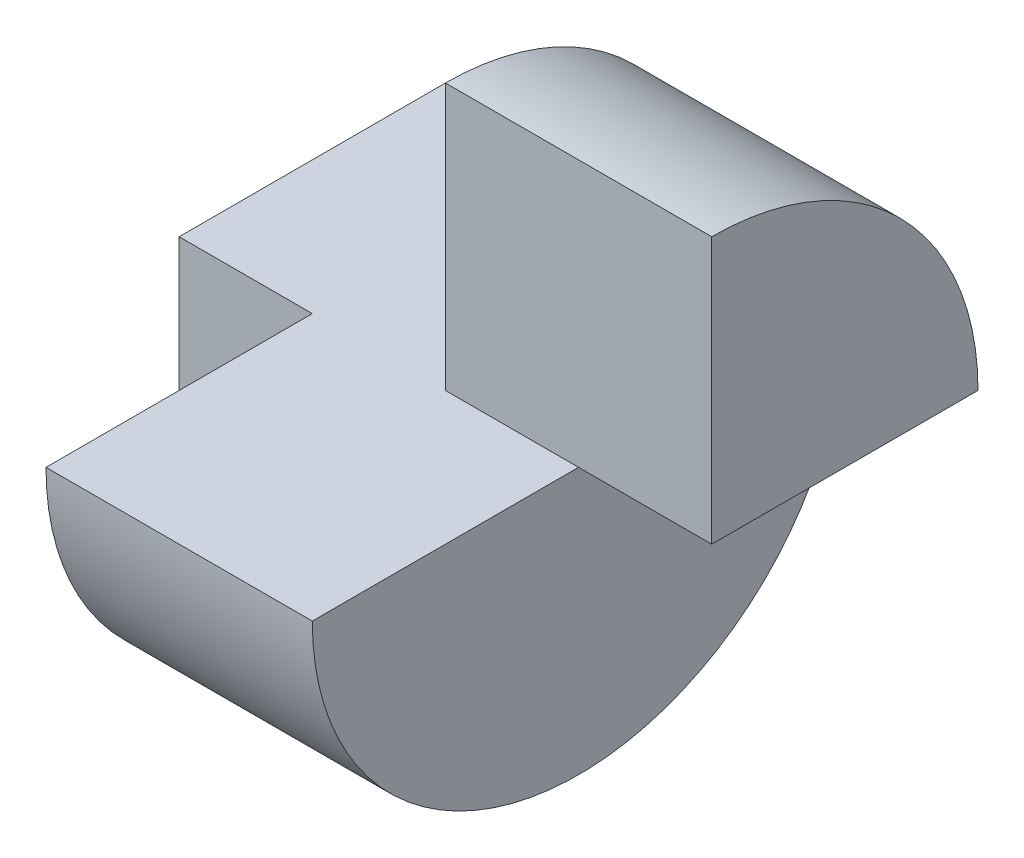
ISO-10303-21;
HEADER;
FILE_DESCRIPTION(('STEP AP214'),'2;1');
FILE_NAME('part.step','',(''),(''),'','','');
FILE_SCHEMA(('AUTOMOTIVE_DESIGN { 1 0 10303 214 1 1 1 1 }'));
ENDSEC;
DATA;
#1=APPLICATION_CONTEXT('core data for automotive mechanical design processes');
#2=APPLICATION_PROTOCOL_DEFINITION('international standard','automotive_design',2000,#1);
#3=PRODUCT_CONTEXT('',#1,'mechanical');
#4=PRODUCT('Part','Part','',(#3));
#5=PRODUCT_RELATED_PRODUCT_CATEGORY('part','',(#4));
#6=PRODUCT_DEFINITION_FORMATION('','',#4);
#7=PRODUCT_DEFINITION_CONTEXT('part definition',#1,'design');
#8=PRODUCT_DEFINITION('design','',#6,#7);
#9=PRODUCT_DEFINITION_SHAPE('','',#8);
#10=(LENGTH_UNIT() NAMED_UNIT(*) SI_UNIT(.MILLI.,.METRE.));
#11=(NAMED_UNIT(*) PLANE_ANGLE_UNIT() SI_UNIT($,.RADIAN.));
#12=(NAMED_UNIT(*) SI_UNIT($,.STERADIAN.) SOLID_ANGLE_UNIT());
#13=UNCERTAINTY_MEASURE_WITH_UNIT(LENGTH_MEASURE(1.E-05),#10,'distance_accuracy_value','');
#14=(GEOMETRIC_REPRESENTATION_CONTEXT(3) GLOBAL_UNCERTAINTY_ASSIGNED_CONTEXT((#13)) GLOBAL_UNIT_ASSIGNED_CONTEXT((#10,
#11,#12)) REPRESENTATION_CONTEXT('',''));
#15=CARTESIAN_POINT('',(0.,0.,0.));
#16=DIRECTION('',(0.,0.,1.));
#17=DIRECTION('',(1.,0.,0.));
#18=AXIS2_PLACEMENT_3D('',#15,#16,#17);
#19=CARTESIAN_POINT('',(0.,0.,40.));
#20=DIRECTION('',(1.,0.,0.));
#21=DIRECTION('',(0.,0.,-1.));
#22=AXIS2_PLACEMENT_3D('',#19,#20,#21);
#23=PLANE('',#22);
#24=CARTESIAN_POINT('',(0.,20.,20.));
#25=DIRECTION('',(-1.,0.,0.));
#26=DIRECTION('',(0.,0.,1.));
#27=AXIS2_PLACEMENT_3D('',#24,#25,#26);
#28=CIRCLE('',#27,20.);
#29=CARTESIAN_POINT('',(0.,0.,20.));
#30=VERTEX_POINT('',#29);
#31=CARTESIAN_POINT('',(0.,20.,0.));
#32=VERTEX_POINT('',#31);
#33=EDGE_CURVE('E132',#30,#32,#28,.F.);
#34=ORIENTED_EDGE('',*,*,#33,.F.);
#35=DIRECTION('',(0.,-1.,0.));
#36=VECTOR('',#35,1.);
#37=CARTESIAN_POINT('',(0.,0.,20.));
#38=LINE('',#37,#36);
#39=CARTESIAN_POINT('',(0.,20.,20.));
#40=VERTEX_POINT('',#39);
#41=EDGE_CURVE('E124',#40,#30,#38,.T.);
#42=ORIENTED_EDGE('',*,*,#41,.F.);
#43=DIRECTION('',(0.,0.,1.));
#44=VECTOR('',#43,1.);
#45=CARTESIAN_POINT('',(0.,20.,0.));
#46=LINE('',#45,#44);
#47=EDGE_CURVE('E130',#32,#40,#46,.T.);
#48=ORIENTED_EDGE('',*,*,#47,.F.);
#49=EDGE_LOOP('',(#34,#42,#48));
#50=FACE_BOUND('',#49,.T.);
#51=ADVANCED_FACE('F51',(#50),#23,.F.);
#52=CARTESIAN_POINT('',(40.,0.,40.));
#53=DIRECTION('',(-1.,0.,0.));
#54=DIRECTION('',(0.,0.,1.));
#55=AXIS2_PLACEMENT_3D('',#52,#53,#54);
#56=PLANE('',#55);
#57=DIRECTION('',(0.,0.,1.));
#58=VECTOR('',#57,1.);
#59=CARTESIAN_POINT('',(40.,20.,0.));
#60=LINE('',#59,#58);
#61=CARTESIAN_POINT('',(40.,20.,0.));
#62=VERTEX_POINT('',#61);
#63=CARTESIAN_POINT('',(40.,20.,20.));
#64=VERTEX_POINT('',#63);
#65=EDGE_CURVE('E157',#62,#64,#60,.T.);
#66=ORIENTED_EDGE('',*,*,#65,.F.);
#67=CARTESIAN_POINT('',(40.,20.,20.));
#68=DIRECTION('',(-1.,0.,0.));
#69=DIRECTION('',(0.,0.,1.));
#70=AXIS2_PLACEMENT_3D('',#67,#68,#69);
#71=CIRCLE('',#70,20.);
#72=CARTESIAN_POINT('',(40.,40.,20.));
#73=VERTEX_POINT('',#72);
#74=EDGE_CURVE('E142',#62,#73,#71,.F.);
#75=ORIENTED_EDGE('',*,*,#74,.T.);
#76=DIRECTION('',(0.,-1.,0.));
#77=VECTOR('',#76,1.);
#78=CARTESIAN_POINT('',(40.,0.,20.));
#79=LINE('',#78,#77);
#80=EDGE_CURVE('E149',#73,#64,#79,.T.);
#81=ORIENTED_EDGE('',*,*,#80,.T.);
#82=EDGE_LOOP('',(#66,#75,#81));
#83=FACE_BOUND('',#82,.T.);
#84=ADVANCED_FACE('F182',(#83),#56,.F.);
#85=CARTESIAN_POINT('',(20.,40.,0.));
#86=DIRECTION('',(1.,0.,0.));
#87=DIRECTION('',(0.,1.,0.));
#88=AXIS2_PLACEMENT_3D('',#85,#86,#87);
#89=PLANE('',#88);
#90=DIRECTION('',(0.,-1.,0.));
#91=VECTOR('',#90,1.);
#92=CARTESIAN_POINT('',(20.,40.,20.));
#93=LINE('',#92,#91);
#94=CARTESIAN_POINT('',(20.,40.,20.));
#95=VERTEX_POINT('',#94);
#96=CARTESIAN_POINT('',(20.,20.,20.));
#97=VERTEX_POINT('',#96);
#98=EDGE_CURVE('E145',#95,#97,#93,.T.);
#99=ORIENTED_EDGE('',*,*,#98,.F.);
#100=CARTESIAN_POINT('',(20.,20.,20.));
#101=DIRECTION('',(1.,0.,0.));
#102=DIRECTION('',(0.,1.,0.));
#103=AXIS2_PLACEMENT_3D('',#100,#101,#102);
#104=CIRCLE('',#103,20.);
#105=CARTESIAN_POINT('',(20.,20.,0.));
#106=VERTEX_POINT('',#105);
#107=EDGE_CURVE('E140',#106,#95,#104,.T.);
#108=ORIENTED_EDGE('',*,*,#107,.F.);
#109=DIRECTION('',(0.,0.,1.));
#110=VECTOR('',#109,1.);
#111=CARTESIAN_POINT('',(20.,20.,0.));
#112=LINE('',#111,#110);
#113=EDGE_CURVE('E58',#106,#97,#112,.T.);
#114=ORIENTED_EDGE('',*,*,#113,.T.);
#115=EDGE_LOOP('',(#99,#108,#114));
#116=FACE_BOUND('',#115,.T.);
#117=ADVANCED_FACE('F173',(#116),#89,.F.);
#118=CARTESIAN_POINT('',(0.,20.,0.));
#119=DIRECTION('',(0.,-1.,0.));
#120=DIRECTION('',(0.,0.,-1.));
#121=AXIS2_PLACEMENT_3D('',#118,#119,#120);
#122=PLANE('',#121);
#123=ORIENTED_EDGE('',*,*,#47,.T.);
#124=DIRECTION('',(-1.,0.,0.));
#125=VECTOR('',#124,1.);
#126=CARTESIAN_POINT('',(10.,20.,20.));
#127=LINE('',#126,#125);
#128=CARTESIAN_POINT('',(10.,20.,20.));
#129=VERTEX_POINT('',#128);
#130=EDGE_CURVE('E112',#129,#40,#127,.T.);
#131=ORIENTED_EDGE('',*,*,#130,.F.);
#132=DIRECTION('',(0.,0.,-1.));
#133=VECTOR('',#132,1.);
#134=CARTESIAN_POINT('',(10.,20.,20.));
#135=LINE('',#134,#133);
#136=CARTESIAN_POINT('',(10.,20.,40.));
#137=VERTEX_POINT('',#136);
#138=EDGE_CURVE('E118',#137,#129,#135,.T.);
#139=ORIENTED_EDGE('',*,*,#138,.F.);
#140=DIRECTION('',(1.,0.,0.));
#141=VECTOR('',#140,1.);
#142=CARTESIAN_POINT('',(0.,20.,40.));
#143=LINE('',#142,#141);
#144=CARTESIAN_POINT('',(30.,20.,40.));
#145=VERTEX_POINT('',#144);
#146=EDGE_CURVE('E161',#137,#145,#143,.T.);
#147=ORIENTED_EDGE('',*,*,#146,.T.);
#148=DIRECTION('',(0.,0.,1.));
#149=VECTOR('',#148,1.);
#150=CARTESIAN_POINT('',(30.,20.,0.));
#151=LINE('',#150,#149);
#152=CARTESIAN_POINT('',(30.,20.,20.));
#153=VERTEX_POINT('',#152);
#154=EDGE_CURVE('E162',#153,#145,#151,.T.);
#155=ORIENTED_EDGE('',*,*,#154,.F.);
#156=DIRECTION('',(-1.,0.,0.));
#157=VECTOR('',#156,1.);
#158=CARTESIAN_POINT('',(60.,20.,20.));
#159=LINE('',#158,#157);
#160=EDGE_CURVE('E73',#153,#97,#159,.T.);
#161=ORIENTED_EDGE('',*,*,#160,.T.);
#162=ORIENTED_EDGE('',*,*,#113,.F.);
#163=DIRECTION('',(1.,0.,0.));
#164=VECTOR('',#163,1.);
#165=CARTESIAN_POINT('',(0.,20.,0.));
#166=LINE('',#165,#164);
#167=EDGE_CURVE('E165',#32,#106,#166,.T.);
#168=ORIENTED_EDGE('',*,*,#167,.F.);
#169=EDGE_LOOP('',(#123,#131,#139,#147,#155,#161,#162,#168));
#170=FACE_BOUND('',#169,.T.);
#171=ADVANCED_FACE('F127',(#170),#122,.F.);
#172=CARTESIAN_POINT('',(30.,0.,0.));
#173=DIRECTION('',(-1.,0.,0.));
#174=DIRECTION('',(0.,0.,1.));
#175=AXIS2_PLACEMENT_3D('',#172,#173,#174);
#176=PLANE('',#175);
#177=ORIENTED_EDGE('',*,*,#154,.T.);
#178=CARTESIAN_POINT('',(30.,20.,20.));
#179=DIRECTION('',(-1.,0.,0.));
#180=DIRECTION('',(0.,0.,1.));
#181=AXIS2_PLACEMENT_3D('',#178,#179,#180);
#182=CIRCLE('',#181,20.);
#183=CARTESIAN_POINT('',(30.,20.,0.));
#184=VERTEX_POINT('',#183);
#185=EDGE_CURVE('E138',#145,#184,#182,.F.);
#186=ORIENTED_EDGE('',*,*,#185,.T.);
#187=EDGE_CURVE('E158',#184,#153,#151,.T.);
#188=ORIENTED_EDGE('',*,*,#187,.T.);
#189=EDGE_LOOP('',(#177,#186,#188));
#190=FACE_BOUND('',#189,.T.);
#191=ADVANCED_FACE('F188',(#190),#176,.F.);
#192=CARTESIAN_POINT('',(40.,20.,0.));
#193=DIRECTION('',(0.,1.,0.));
#194=DIRECTION('',(-1.,0.,0.));
#195=AXIS2_PLACEMENT_3D('',#192,#193,#194);
#196=PLANE('',#195);
#197=ORIENTED_EDGE('',*,*,#65,.T.);
#198=DIRECTION('',(-1.,0.,0.));
#199=VECTOR('',#198,1.);
#200=CARTESIAN_POINT('',(40.,20.,20.));
#201=LINE('',#200,#199);
#202=EDGE_CURVE('E12',#64,#153,#201,.T.);
#203=ORIENTED_EDGE('',*,*,#202,.T.);
#204=ORIENTED_EDGE('',*,*,#187,.F.);
#205=DIRECTION('',(-1.,0.,0.));
#206=VECTOR('',#205,1.);
#207=CARTESIAN_POINT('',(40.,20.,0.));
#208=LINE('',#207,#206);
#209=EDGE_CURVE('E154',#62,#184,#208,.T.);
#210=ORIENTED_EDGE('',*,*,#209,.F.);
#211=EDGE_LOOP('',(#197,#203,#204,#210));
#212=FACE_BOUND('',#211,.T.);
#213=ADVANCED_FACE('F184',(#212),#196,.F.);
#214=CARTESIAN_POINT('',(60.,40.,20.));
#215=DIRECTION('',(0.,0.,-1.));
#216=DIRECTION('',(0.,1.,0.));
#217=AXIS2_PLACEMENT_3D('',#214,#215,#216);
#218=PLANE('',#217);
#219=DIRECTION('',(-1.,0.,0.));
#220=VECTOR('',#219,1.);
#221=CARTESIAN_POINT('',(60.,40.,20.));
#222=LINE('',#221,#220);
#223=EDGE_CURVE('E147',#73,#95,#222,.T.);
#224=ORIENTED_EDGE('',*,*,#223,.T.);
#225=ORIENTED_EDGE('',*,*,#98,.T.);
#226=ORIENTED_EDGE('',*,*,#160,.F.);
#227=ORIENTED_EDGE('',*,*,#202,.F.);
#228=ORIENTED_EDGE('',*,*,#80,.F.);
#229=EDGE_LOOP('',(#224,#225,#226,#227,#228));
#230=FACE_BOUND('',#229,.T.);
#231=ADVANCED_FACE('F175',(#230),#218,.F.);
#232=CARTESIAN_POINT('',(60.,20.,20.));
#233=DIRECTION('',(-1.,0.,0.));
#234=DIRECTION('',(0.,-1.,0.));
#235=AXIS2_PLACEMENT_3D('',#232,#233,#234);
#236=CYLINDRICAL_SURFACE('',#235,20.);
#237=CARTESIAN_POINT('',(10.,20.,20.));
#238=DIRECTION('',(-1.,0.,0.));
#239=DIRECTION('',(0.,0.,-1.));
#240=AXIS2_PLACEMENT_3D('',#237,#238,#239);
#241=CIRCLE('',#240,20.);
#242=CARTESIAN_POINT('',(10.,0.,20.));
#243=VERTEX_POINT('',#242);
#244=EDGE_CURVE('E117',#243,#137,#241,.T.);
#245=ORIENTED_EDGE('',*,*,#244,.F.);
#246=DIRECTION('',(-1.,0.,0.));
#247=VECTOR('',#246,1.);
#248=CARTESIAN_POINT('',(10.,0.,20.));
#249=LINE('',#248,#247);
#250=EDGE_CURVE('E115',#243,#30,#249,.T.);
#251=ORIENTED_EDGE('',*,*,#250,.T.);
#252=ORIENTED_EDGE('',*,*,#33,.T.);
#253=ORIENTED_EDGE('',*,*,#167,.T.);
#254=ORIENTED_EDGE('',*,*,#107,.T.);
#255=ORIENTED_EDGE('',*,*,#223,.F.);
#256=ORIENTED_EDGE('',*,*,#74,.F.);
#257=ORIENTED_EDGE('',*,*,#209,.T.);
#258=ORIENTED_EDGE('',*,*,#185,.F.);
#259=ORIENTED_EDGE('',*,*,#146,.F.);
#260=EDGE_LOOP('',(#245,#251,#252,#253,#254,#255,#256,#257,#258,#259));
#261=FACE_BOUND('',#260,.T.);
#262=ADVANCED_FACE('F178',(#261),#236,.T.);
#263=CARTESIAN_POINT('',(10.,0.,20.));
#264=DIRECTION('',(0.,0.,-1.));
#265=DIRECTION('',(-1.,0.,0.));
#266=AXIS2_PLACEMENT_3D('',#263,#264,#265);
#267=PLANE('',#266);
#268=ORIENTED_EDGE('',*,*,#41,.T.);
#269=ORIENTED_EDGE('',*,*,#250,.F.);
#270=DIRECTION('',(0.,-1.,0.));
#271=VECTOR('',#270,1.);
#272=CARTESIAN_POINT('',(10.,0.,20.));
#273=LINE('',#272,#271);
#274=EDGE_CURVE('E65',#129,#243,#273,.T.);
#275=ORIENTED_EDGE('',*,*,#274,.F.);
#276=ORIENTED_EDGE('',*,*,#130,.T.);
#277=EDGE_LOOP('',(#268,#269,#275,#276));
#278=FACE_BOUND('',#277,.T.);
#279=ADVANCED_FACE('F110',(#278),#267,.F.);
#280=CARTESIAN_POINT('',(10.,20.,20.));
#281=DIRECTION('',(1.,0.,0.));
#282=DIRECTION('',(0.,0.,-1.));
#283=AXIS2_PLACEMENT_3D('',#280,#281,#282);
#284=PLANE('',#283);
#285=ORIENTED_EDGE('',*,*,#138,.T.);
#286=ORIENTED_EDGE('',*,*,#274,.T.);
#287=ORIENTED_EDGE('',*,*,#244,.T.);
#288=EDGE_LOOP('',(#285,#286,#287));
#289=FACE_BOUND('',#288,.T.);
#290=ADVANCED_FACE('F121',(#289),#284,.F.);
#291=CLOSED_SHELL('',(#51,#84,#117,#171,#191,#213,#231,#262,#279,#290));
#292=MANIFOLD_SOLID_BREP('B2',#291);
#293=ADVANCED_BREP_SHAPE_REPRESENTATION('',(#18,#292),#14);
#294=SHAPE_DEFINITION_REPRESENTATION(#9,#293);
ENDSEC;
END-ISO-10303-21;
